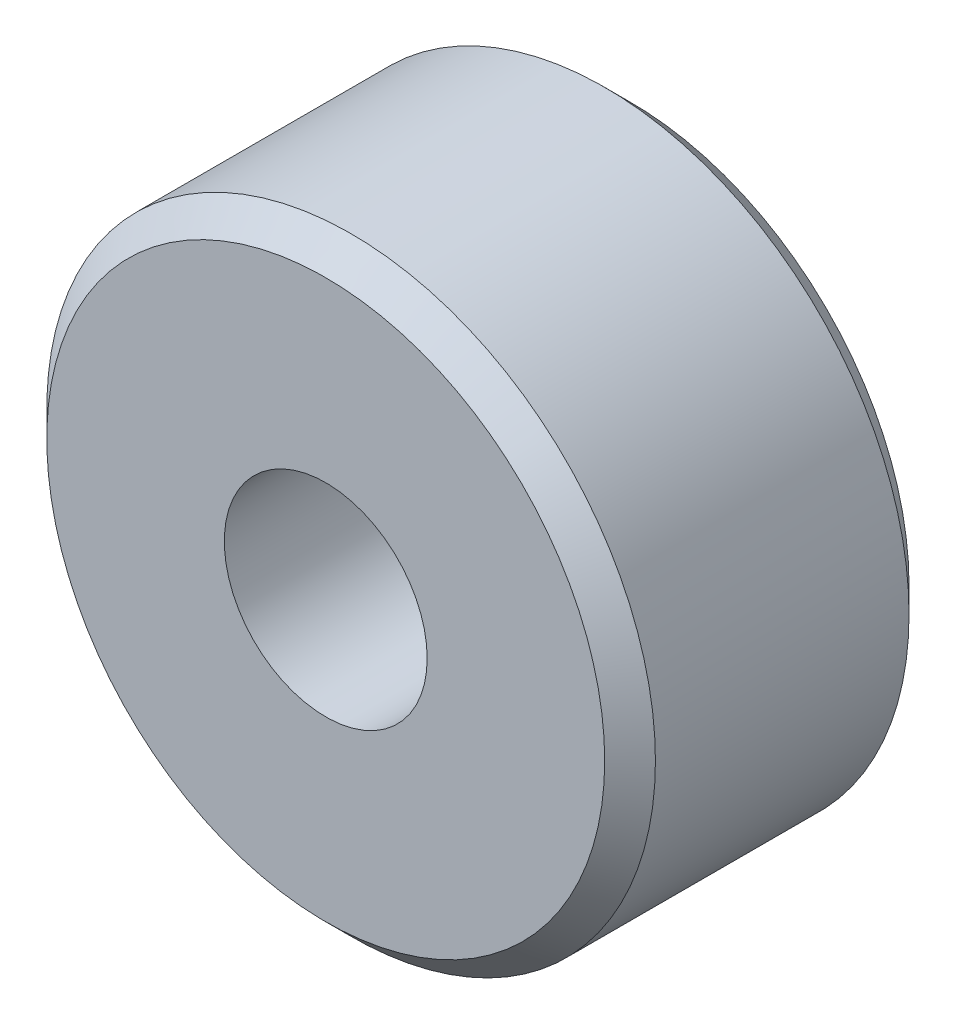
ISO-10303-21;
HEADER;
FILE_DESCRIPTION(('STEP AP214'),'2;1');
FILE_NAME('part.step','',(''),(''),'','','');
FILE_SCHEMA(('AUTOMOTIVE_DESIGN { 1 0 10303 214 1 1 1 1 }'));
ENDSEC;
DATA;
#1=APPLICATION_CONTEXT('core data for automotive mechanical design processes');
#2=APPLICATION_PROTOCOL_DEFINITION('international standard','automotive_design',2000,#1);
#3=PRODUCT_CONTEXT('',#1,'mechanical');
#4=PRODUCT('Part','Part','',(#3));
#5=PRODUCT_RELATED_PRODUCT_CATEGORY('part','',(#4));
#6=PRODUCT_DEFINITION_FORMATION('','',#4);
#7=PRODUCT_DEFINITION_CONTEXT('part definition',#1,'design');
#8=PRODUCT_DEFINITION('design','',#6,#7);
#9=PRODUCT_DEFINITION_SHAPE('','',#8);
#10=(LENGTH_UNIT() NAMED_UNIT(*) SI_UNIT(.MILLI.,.METRE.));
#11=(NAMED_UNIT(*) PLANE_ANGLE_UNIT() SI_UNIT($,.RADIAN.));
#12=(NAMED_UNIT(*) SI_UNIT($,.STERADIAN.) SOLID_ANGLE_UNIT());
#13=UNCERTAINTY_MEASURE_WITH_UNIT(LENGTH_MEASURE(1.E-05),#10,'distance_accuracy_value','');
#14=(GEOMETRIC_REPRESENTATION_CONTEXT(3) GLOBAL_UNCERTAINTY_ASSIGNED_CONTEXT((#13)) GLOBAL_UNIT_ASSIGNED_CONTEXT((#10,
#11,#12)) REPRESENTATION_CONTEXT('',''));
#15=CARTESIAN_POINT('',(0.,0.,0.));
#16=DIRECTION('',(0.,0.,1.));
#17=DIRECTION('',(1.,0.,0.));
#18=AXIS2_PLACEMENT_3D('',#15,#16,#17);
#19=CARTESIAN_POINT('',(0.,0.,3.));
#20=DIRECTION('',(0.,0.,1.));
#21=DIRECTION('',(1.,0.,0.));
#22=AXIS2_PLACEMENT_3D('',#19,#20,#21);
#23=PLANE('',#22);
#24=CARTESIAN_POINT('',(0.,0.,3.));
#25=DIRECTION('',(0.,0.,1.));
#26=DIRECTION('',(1.,0.,0.));
#27=AXIS2_PLACEMENT_3D('',#24,#25,#26);
#28=CIRCLE('',#27,2.75);
#29=CARTESIAN_POINT('',(2.75,0.,3.));
#30=VERTEX_POINT('',#29);
#31=EDGE_CURVE('E11',#30,#30,#28,.T.);
#32=ORIENTED_EDGE('',*,*,#31,.T.);
#33=EDGE_LOOP('',(#32));
#34=FACE_BOUND('',#33,.T.);
#35=CARTESIAN_POINT('',(0.,0.,3.));
#36=DIRECTION('',(0.,0.,1.));
#37=DIRECTION('',(1.,0.,0.));
#38=AXIS2_PLACEMENT_3D('',#35,#36,#37);
#39=CIRCLE('',#38,1.);
#40=CARTESIAN_POINT('',(1.,0.,3.));
#41=VERTEX_POINT('',#40);
#42=EDGE_CURVE('E59',#41,#41,#39,.T.);
#43=ORIENTED_EDGE('',*,*,#42,.F.);
#44=EDGE_LOOP('',(#43));
#45=FACE_BOUND('',#44,.T.);
#46=ADVANCED_FACE('F38',(#34,#45),#23,.T.);
#47=CARTESIAN_POINT('',(0.,0.,0.));
#48=DIRECTION('',(0.,0.,1.));
#49=DIRECTION('',(1.,0.,0.));
#50=AXIS2_PLACEMENT_3D('',#47,#48,#49);
#51=PLANE('',#50);
#52=CARTESIAN_POINT('',(0.,0.,0.));
#53=DIRECTION('',(0.,0.,1.));
#54=DIRECTION('',(1.,0.,0.));
#55=AXIS2_PLACEMENT_3D('',#52,#53,#54);
#56=CIRCLE('',#55,2.75);
#57=CARTESIAN_POINT('',(2.75,0.,0.));
#58=VERTEX_POINT('',#57);
#59=EDGE_CURVE('E46',#58,#58,#56,.F.);
#60=ORIENTED_EDGE('',*,*,#59,.T.);
#61=EDGE_LOOP('',(#60));
#62=FACE_BOUND('',#61,.T.);
#63=CARTESIAN_POINT('',(0.,0.,0.));
#64=DIRECTION('',(0.,0.,1.));
#65=DIRECTION('',(1.,0.,0.));
#66=AXIS2_PLACEMENT_3D('',#63,#64,#65);
#67=CIRCLE('',#66,1.);
#68=CARTESIAN_POINT('',(1.,0.,0.));
#69=VERTEX_POINT('',#68);
#70=EDGE_CURVE('E60',#69,#69,#67,.T.);
#71=ORIENTED_EDGE('',*,*,#70,.T.);
#72=EDGE_LOOP('',(#71));
#73=FACE_BOUND('',#72,.T.);
#74=ADVANCED_FACE('F70',(#62,#73),#51,.F.);
#75=CARTESIAN_POINT('',(0.,0.,3.));
#76=DIRECTION('',(0.,0.,-1.));
#77=DIRECTION('',(-1.,0.,0.));
#78=AXIS2_PLACEMENT_3D('',#75,#76,#77);
#79=CYLINDRICAL_SURFACE('',#78,3.);
#80=CARTESIAN_POINT('',(0.,0.,0.250000000000001));
#81=DIRECTION('',(0.,0.,1.));
#82=DIRECTION('',(1.,0.,0.));
#83=AXIS2_PLACEMENT_3D('',#80,#81,#82);
#84=CIRCLE('',#83,3.);
#85=CARTESIAN_POINT('',(3.,0.,0.250000000000001));
#86=VERTEX_POINT('',#85);
#87=EDGE_CURVE('E50',#86,#86,#84,.T.);
#88=ORIENTED_EDGE('',*,*,#87,.T.);
#89=EDGE_LOOP('',(#88));
#90=FACE_BOUND('',#89,.T.);
#91=CARTESIAN_POINT('',(0.,0.,2.75));
#92=DIRECTION('',(0.,0.,1.));
#93=DIRECTION('',(1.,0.,0.));
#94=AXIS2_PLACEMENT_3D('',#91,#92,#93);
#95=CIRCLE('',#94,3.);
#96=CARTESIAN_POINT('',(3.,0.,2.75));
#97=VERTEX_POINT('',#96);
#98=EDGE_CURVE('E54',#97,#97,#95,.F.);
#99=ORIENTED_EDGE('',*,*,#98,.T.);
#100=EDGE_LOOP('',(#99));
#101=FACE_BOUND('',#100,.T.);
#102=ADVANCED_FACE('F75',(#90,#101),#79,.T.);
#103=CARTESIAN_POINT('',(0.,0.,3.));
#104=DIRECTION('',(0.,0.,-1.));
#105=DIRECTION('',(-1.,0.,0.));
#106=AXIS2_PLACEMENT_3D('',#103,#104,#105);
#107=CYLINDRICAL_SURFACE('',#106,1.);
#108=ORIENTED_EDGE('',*,*,#42,.T.);
#109=EDGE_LOOP('',(#108));
#110=FACE_BOUND('',#109,.T.);
#111=ORIENTED_EDGE('',*,*,#70,.F.);
#112=EDGE_LOOP('',(#111));
#113=FACE_BOUND('',#112,.T.);
#114=ADVANCED_FACE('F66',(#110,#113),#107,.F.);
#115=CARTESIAN_POINT('',(0.,0.,0.250000000000001));
#116=DIRECTION('',(0.,0.,1.));
#117=DIRECTION('',(1.,0.,0.));
#118=AXIS2_PLACEMENT_3D('',#115,#116,#117);
#119=CONICAL_SURFACE('',#118,3.,0.78539816339745);
#120=ORIENTED_EDGE('',*,*,#59,.F.);
#121=EDGE_LOOP('',(#120));
#122=FACE_BOUND('',#121,.T.);
#123=ORIENTED_EDGE('',*,*,#87,.F.);
#124=EDGE_LOOP('',(#123));
#125=FACE_BOUND('',#124,.T.);
#126=ADVANCED_FACE('F82',(#122,#125),#119,.T.);
#127=CARTESIAN_POINT('',(0.,0.,3.));
#128=DIRECTION('',(0.,0.,-1.));
#129=DIRECTION('',(-1.,0.,0.));
#130=AXIS2_PLACEMENT_3D('',#127,#128,#129);
#131=CONICAL_SURFACE('',#130,2.75,0.785398163397447);
#132=ORIENTED_EDGE('',*,*,#98,.F.);
#133=EDGE_LOOP('',(#132));
#134=FACE_BOUND('',#133,.T.);
#135=ORIENTED_EDGE('',*,*,#31,.F.);
#136=EDGE_LOOP('',(#135));
#137=FACE_BOUND('',#136,.T.);
#138=ADVANCED_FACE('F41',(#134,#137),#131,.T.);
#139=CLOSED_SHELL('',(#46,#74,#102,#114,#126,#138));
#140=MANIFOLD_SOLID_BREP('B2',#139);
#141=ADVANCED_BREP_SHAPE_REPRESENTATION('',(#18,#140),#14);
#142=SHAPE_DEFINITION_REPRESENTATION(#9,#141);
ENDSEC;
END-ISO-10303-21;
